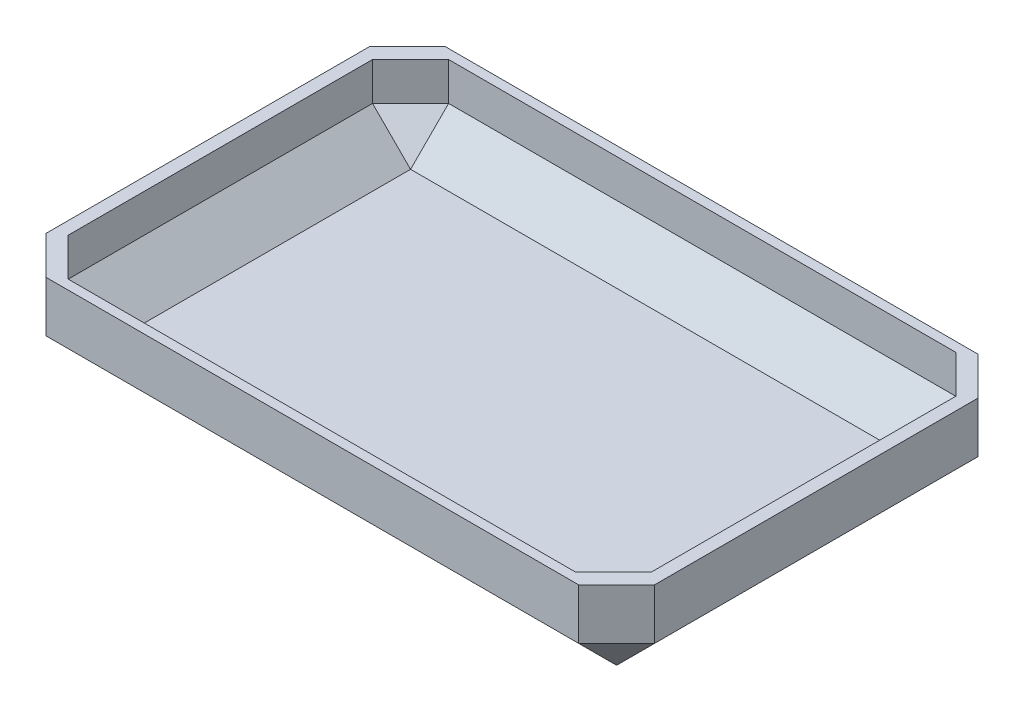
ISO-10303-21;
HEADER;
FILE_DESCRIPTION(('STEP AP214'),'2;1');
FILE_NAME('part.step','',(''),(''),'','','');
FILE_SCHEMA(('AUTOMOTIVE_DESIGN { 1 0 10303 214 1 1 1 1 }'));
ENDSEC;
DATA;
#1=APPLICATION_CONTEXT('core data for automotive mechanical design processes');
#2=APPLICATION_PROTOCOL_DEFINITION('international standard','automotive_design',2000,#1);
#3=PRODUCT_CONTEXT('',#1,'mechanical');
#4=PRODUCT('Part','Part','',(#3));
#5=PRODUCT_RELATED_PRODUCT_CATEGORY('part','',(#4));
#6=PRODUCT_DEFINITION_FORMATION('','',#4);
#7=PRODUCT_DEFINITION_CONTEXT('part definition',#1,'design');
#8=PRODUCT_DEFINITION('design','',#6,#7);
#9=PRODUCT_DEFINITION_SHAPE('','',#8);
#10=(LENGTH_UNIT() NAMED_UNIT(*) SI_UNIT(.MILLI.,.METRE.));
#11=(NAMED_UNIT(*) PLANE_ANGLE_UNIT() SI_UNIT($,.RADIAN.));
#12=(NAMED_UNIT(*) SI_UNIT($,.STERADIAN.) SOLID_ANGLE_UNIT());
#13=UNCERTAINTY_MEASURE_WITH_UNIT(LENGTH_MEASURE(1.E-05),#10,'distance_accuracy_value','');
#14=(GEOMETRIC_REPRESENTATION_CONTEXT(3) GLOBAL_UNCERTAINTY_ASSIGNED_CONTEXT((#13)) GLOBAL_UNIT_ASSIGNED_CONTEXT((#10,
#11,#12)) REPRESENTATION_CONTEXT('',''));
#15=CARTESIAN_POINT('',(0.,0.,0.));
#16=DIRECTION('',(0.,0.,1.));
#17=DIRECTION('',(1.,0.,0.));
#18=AXIS2_PLACEMENT_3D('',#15,#16,#17);
#19=CARTESIAN_POINT('',(-240.,70.,-157.5));
#20=DIRECTION('',(1.,0.,0.));
#21=DIRECTION('',(0.,0.,-1.));
#22=AXIS2_PLACEMENT_3D('',#19,#20,#21);
#23=PLANE('',#22);
#24=DIRECTION('',(0.,0.,1.));
#25=VECTOR('',#24,1.);
#26=CARTESIAN_POINT('',(-240.,30.,157.5));
#27=LINE('',#26,#25);
#28=CARTESIAN_POINT('',(-240.,30.,-127.5));
#29=VERTEX_POINT('',#28);
#30=CARTESIAN_POINT('',(-240.,30.,127.5));
#31=VERTEX_POINT('',#30);
#32=EDGE_CURVE('E268',#29,#31,#27,.T.);
#33=ORIENTED_EDGE('',*,*,#32,.T.);
#34=DIRECTION('',(0.,1.,0.));
#35=VECTOR('',#34,1.);
#36=CARTESIAN_POINT('',(-240.,70.,127.5));
#37=LINE('',#36,#35);
#38=CARTESIAN_POINT('',(-240.,70.,127.5));
#39=VERTEX_POINT('',#38);
#40=EDGE_CURVE('E272',#31,#39,#37,.T.);
#41=ORIENTED_EDGE('',*,*,#40,.T.);
#42=DIRECTION('',(0.,0.,1.));
#43=VECTOR('',#42,1.);
#44=CARTESIAN_POINT('',(-240.,70.,-157.5));
#45=LINE('',#44,#43);
#46=CARTESIAN_POINT('',(-240.,70.,-127.5));
#47=VERTEX_POINT('',#46);
#48=EDGE_CURVE('E222',#47,#39,#45,.T.);
#49=ORIENTED_EDGE('',*,*,#48,.F.);
#50=DIRECTION('',(0.,-1.,0.));
#51=VECTOR('',#50,1.);
#52=CARTESIAN_POINT('',(-240.,70.,-127.5));
#53=LINE('',#52,#51);
#54=EDGE_CURVE('E270',#47,#29,#53,.T.);
#55=ORIENTED_EDGE('',*,*,#54,.T.);
#56=EDGE_LOOP('',(#33,#41,#49,#55));
#57=FACE_BOUND('',#56,.T.);
#58=ADVANCED_FACE('F41',(#57),#23,.F.);
#59=CARTESIAN_POINT('',(240.,70.,157.5));
#60=DIRECTION('',(0.,0.,-1.));
#61=DIRECTION('',(-1.,0.,0.));
#62=AXIS2_PLACEMENT_3D('',#59,#60,#61);
#63=PLANE('',#62);
#64=DIRECTION('',(1.,0.,0.));
#65=VECTOR('',#64,1.);
#66=CARTESIAN_POINT('',(240.,70.,157.5));
#67=LINE('',#66,#65);
#68=CARTESIAN_POINT('',(-210.,70.,157.5));
#69=VERTEX_POINT('',#68);
#70=CARTESIAN_POINT('',(210.,70.,157.5));
#71=VERTEX_POINT('',#70);
#72=EDGE_CURVE('E225',#69,#71,#67,.T.);
#73=ORIENTED_EDGE('',*,*,#72,.F.);
#74=DIRECTION('',(0.,-1.,0.));
#75=VECTOR('',#74,1.);
#76=CARTESIAN_POINT('',(-210.,70.,157.5));
#77=LINE('',#76,#75);
#78=CARTESIAN_POINT('',(-210.,30.,157.5));
#79=VERTEX_POINT('',#78);
#80=EDGE_CURVE('E265',#69,#79,#77,.T.);
#81=ORIENTED_EDGE('',*,*,#80,.T.);
#82=DIRECTION('',(1.,0.,0.));
#83=VECTOR('',#82,1.);
#84=CARTESIAN_POINT('',(240.,30.,157.5));
#85=LINE('',#84,#83);
#86=CARTESIAN_POINT('',(210.,30.,157.5));
#87=VERTEX_POINT('',#86);
#88=EDGE_CURVE('E261',#79,#87,#85,.T.);
#89=ORIENTED_EDGE('',*,*,#88,.T.);
#90=DIRECTION('',(0.,1.,0.));
#91=VECTOR('',#90,1.);
#92=CARTESIAN_POINT('',(210.,70.,157.5));
#93=LINE('',#92,#91);
#94=EDGE_CURVE('E263',#87,#71,#93,.T.);
#95=ORIENTED_EDGE('',*,*,#94,.T.);
#96=EDGE_LOOP('',(#73,#81,#89,#95));
#97=FACE_BOUND('',#96,.T.);
#98=ADVANCED_FACE('F435',(#97),#63,.F.);
#99=CARTESIAN_POINT('',(240.,70.,-157.5));
#100=DIRECTION('',(-1.,0.,0.));
#101=DIRECTION('',(0.,0.,1.));
#102=AXIS2_PLACEMENT_3D('',#99,#100,#101);
#103=PLANE('',#102);
#104=DIRECTION('',(0.,0.,-1.));
#105=VECTOR('',#104,1.);
#106=CARTESIAN_POINT('',(240.,70.,-157.5));
#107=LINE('',#106,#105);
#108=CARTESIAN_POINT('',(240.,70.,127.5));
#109=VERTEX_POINT('',#108);
#110=CARTESIAN_POINT('',(240.,70.,-127.5));
#111=VERTEX_POINT('',#110);
#112=EDGE_CURVE('E228',#109,#111,#107,.T.);
#113=ORIENTED_EDGE('',*,*,#112,.F.);
#114=DIRECTION('',(0.,-1.,0.));
#115=VECTOR('',#114,1.);
#116=CARTESIAN_POINT('',(240.,70.,127.5));
#117=LINE('',#116,#115);
#118=CARTESIAN_POINT('',(240.,30.0000000000001,127.5));
#119=VERTEX_POINT('',#118);
#120=EDGE_CURVE('E278',#109,#119,#117,.T.);
#121=ORIENTED_EDGE('',*,*,#120,.T.);
#122=DIRECTION('',(0.,0.,-1.));
#123=VECTOR('',#122,1.);
#124=CARTESIAN_POINT('',(240.,30.0000000000001,-157.5));
#125=LINE('',#124,#123);
#126=CARTESIAN_POINT('',(240.,30.0000000000001,-127.5));
#127=VERTEX_POINT('',#126);
#128=EDGE_CURVE('E276',#119,#127,#125,.T.);
#129=ORIENTED_EDGE('',*,*,#128,.T.);
#130=DIRECTION('',(0.,1.,0.));
#131=VECTOR('',#130,1.);
#132=CARTESIAN_POINT('',(240.,70.,-127.5));
#133=LINE('',#132,#131);
#134=EDGE_CURVE('E274',#127,#111,#133,.T.);
#135=ORIENTED_EDGE('',*,*,#134,.T.);
#136=EDGE_LOOP('',(#113,#121,#129,#135));
#137=FACE_BOUND('',#136,.T.);
#138=ADVANCED_FACE('F378',(#137),#103,.F.);
#139=CARTESIAN_POINT('',(240.,70.,-157.5));
#140=DIRECTION('',(0.,0.,1.));
#141=DIRECTION('',(1.,0.,0.));
#142=AXIS2_PLACEMENT_3D('',#139,#140,#141);
#143=PLANE('',#142);
#144=DIRECTION('',(-1.,0.,0.));
#145=VECTOR('',#144,1.);
#146=CARTESIAN_POINT('',(-240.,30.,-157.5));
#147=LINE('',#146,#145);
#148=CARTESIAN_POINT('',(210.,30.,-157.5));
#149=VERTEX_POINT('',#148);
#150=CARTESIAN_POINT('',(-210.,30.,-157.5));
#151=VERTEX_POINT('',#150);
#152=EDGE_CURVE('E282',#149,#151,#147,.T.);
#153=ORIENTED_EDGE('',*,*,#152,.T.);
#154=DIRECTION('',(0.,1.,0.));
#155=VECTOR('',#154,1.);
#156=CARTESIAN_POINT('',(-210.,70.,-157.5));
#157=LINE('',#156,#155);
#158=CARTESIAN_POINT('',(-210.,70.,-157.5));
#159=VERTEX_POINT('',#158);
#160=EDGE_CURVE('E284',#151,#159,#157,.T.);
#161=ORIENTED_EDGE('',*,*,#160,.T.);
#162=DIRECTION('',(-1.,0.,0.));
#163=VECTOR('',#162,1.);
#164=CARTESIAN_POINT('',(240.,70.,-157.5));
#165=LINE('',#164,#163);
#166=CARTESIAN_POINT('',(210.,70.,-157.5));
#167=VERTEX_POINT('',#166);
#168=EDGE_CURVE('E231',#167,#159,#165,.T.);
#169=ORIENTED_EDGE('',*,*,#168,.F.);
#170=DIRECTION('',(0.,-1.,0.));
#171=VECTOR('',#170,1.);
#172=CARTESIAN_POINT('',(210.,70.,-157.5));
#173=LINE('',#172,#171);
#174=EDGE_CURVE('E280',#167,#149,#173,.T.);
#175=ORIENTED_EDGE('',*,*,#174,.T.);
#176=EDGE_LOOP('',(#153,#161,#169,#175));
#177=FACE_BOUND('',#176,.T.);
#178=ADVANCED_FACE('F431',(#177),#143,.F.);
#179=CARTESIAN_POINT('',(0.,70.,0.));
#180=DIRECTION('',(0.,-1.,0.));
#181=DIRECTION('',(0.,0.,-1.));
#182=AXIS2_PLACEMENT_3D('',#179,#180,#181);
#183=PLANE('',#182);
#184=DIRECTION('',(-1.,0.,0.));
#185=VECTOR('',#184,1.);
#186=CARTESIAN_POINT('',(-230.,70.,-150.));
#187=LINE('',#186,#185);
#188=CARTESIAN_POINT('',(200.,70.,-150.));
#189=VERTEX_POINT('',#188);
#190=CARTESIAN_POINT('',(-200.,70.,-150.));
#191=VERTEX_POINT('',#190);
#192=EDGE_CURVE('E198',#189,#191,#187,.T.);
#193=ORIENTED_EDGE('',*,*,#192,.F.);
#194=DIRECTION('',(-0.707106781186551,0.,-0.707106781186544));
#195=VECTOR('',#194,1.);
#196=CARTESIAN_POINT('',(174.999999999999,70.,-175.000000000001));
#197=LINE('',#196,#195);
#198=CARTESIAN_POINT('',(230.,70.,-120.));
#199=VERTEX_POINT('',#198);
#200=EDGE_CURVE('E182',#189,#199,#197,.F.);
#201=ORIENTED_EDGE('',*,*,#200,.T.);
#202=DIRECTION('',(0.,0.,-1.));
#203=VECTOR('',#202,1.);
#204=CARTESIAN_POINT('',(230.,70.,-150.));
#205=LINE('',#204,#203);
#206=CARTESIAN_POINT('',(230.,70.,120.));
#207=VERTEX_POINT('',#206);
#208=EDGE_CURVE('E212',#207,#199,#205,.T.);
#209=ORIENTED_EDGE('',*,*,#208,.F.);
#210=DIRECTION('',(0.707106781186543,0.,-0.707106781186552));
#211=VECTOR('',#210,1.);
#212=CARTESIAN_POINT('',(175.000000000001,70.,174.999999999999));
#213=LINE('',#212,#211);
#214=CARTESIAN_POINT('',(200.,70.,150.));
#215=VERTEX_POINT('',#214);
#216=EDGE_CURVE('E293',#207,#215,#213,.F.);
#217=ORIENTED_EDGE('',*,*,#216,.T.);
#218=DIRECTION('',(1.,0.,0.));
#219=VECTOR('',#218,1.);
#220=CARTESIAN_POINT('',(-230.,70.,150.));
#221=LINE('',#220,#219);
#222=CARTESIAN_POINT('',(-200.,70.,150.));
#223=VERTEX_POINT('',#222);
#224=EDGE_CURVE('E215',#223,#215,#221,.T.);
#225=ORIENTED_EDGE('',*,*,#224,.F.);
#226=DIRECTION('',(0.707106781186544,0.,0.707106781186551));
#227=VECTOR('',#226,1.);
#228=CARTESIAN_POINT('',(-175.000000000001,70.,174.999999999999));
#229=LINE('',#228,#227);
#230=CARTESIAN_POINT('',(-230.,70.,120.));
#231=VERTEX_POINT('',#230);
#232=EDGE_CURVE('E192',#223,#231,#229,.F.);
#233=ORIENTED_EDGE('',*,*,#232,.T.);
#234=DIRECTION('',(0.,0.,1.));
#235=VECTOR('',#234,1.);
#236=CARTESIAN_POINT('',(-230.,70.,-150.));
#237=LINE('',#236,#235);
#238=CARTESIAN_POINT('',(-230.,70.,-120.));
#239=VERTEX_POINT('',#238);
#240=EDGE_CURVE('E211',#239,#231,#237,.T.);
#241=ORIENTED_EDGE('',*,*,#240,.F.);
#242=DIRECTION('',(-0.707106781186544,0.,0.707106781186551));
#243=VECTOR('',#242,1.);
#244=CARTESIAN_POINT('',(-175.000000000001,70.,-174.999999999999));
#245=LINE('',#244,#243);
#246=EDGE_CURVE('E210',#239,#191,#245,.F.);
#247=ORIENTED_EDGE('',*,*,#246,.T.);
#248=EDGE_LOOP('',(#193,#201,#209,#217,#225,#233,#241,#247));
#249=FACE_BOUND('',#248,.T.);
#250=ORIENTED_EDGE('',*,*,#48,.T.);
#251=DIRECTION('',(-0.707106781186546,0.,-0.707106781186549));
#252=VECTOR('',#251,1.);
#253=CARTESIAN_POINT('',(-210.,70.,157.5));
#254=LINE('',#253,#252);
#255=EDGE_CURVE('E11',#39,#69,#254,.F.);
#256=ORIENTED_EDGE('',*,*,#255,.T.);
#257=ORIENTED_EDGE('',*,*,#72,.T.);
#258=DIRECTION('',(-0.707106781186547,0.,0.707106781186549));
#259=VECTOR('',#258,1.);
#260=CARTESIAN_POINT('',(240.,70.,127.5));
#261=LINE('',#260,#259);
#262=EDGE_CURVE('E51',#71,#109,#261,.F.);
#263=ORIENTED_EDGE('',*,*,#262,.T.);
#264=ORIENTED_EDGE('',*,*,#112,.T.);
#265=DIRECTION('',(0.707106781186546,0.,0.707106781186549));
#266=VECTOR('',#265,1.);
#267=CARTESIAN_POINT('',(210.,70.,-157.5));
#268=LINE('',#267,#266);
#269=EDGE_CURVE('E296',#111,#167,#268,.F.);
#270=ORIENTED_EDGE('',*,*,#269,.T.);
#271=ORIENTED_EDGE('',*,*,#168,.T.);
#272=DIRECTION('',(0.707106781186546,0.,-0.707106781186549));
#273=VECTOR('',#272,1.);
#274=CARTESIAN_POINT('',(-240.,70.,-127.5));
#275=LINE('',#274,#273);
#276=EDGE_CURVE('E298',#159,#47,#275,.F.);
#277=ORIENTED_EDGE('',*,*,#276,.T.);
#278=EDGE_LOOP('',(#250,#256,#257,#263,#264,#270,#271,#277));
#279=FACE_BOUND('',#278,.T.);
#280=ADVANCED_FACE('F206',(#249,#279),#183,.F.);
#281=CARTESIAN_POINT('',(0.,0.,0.));
#282=DIRECTION('',(0.,-1.,0.));
#283=DIRECTION('',(0.,0.,-1.));
#284=AXIS2_PLACEMENT_3D('',#281,#282,#283);
#285=PLANE('',#284);
#286=DIRECTION('',(-1.,0.,0.));
#287=VECTOR('',#286,1.);
#288=CARTESIAN_POINT('',(-240.,0.,127.5));
#289=LINE('',#288,#287);
#290=CARTESIAN_POINT('',(210.,0.,127.5));
#291=VERTEX_POINT('',#290);
#292=CARTESIAN_POINT('',(-210.,0.,127.5));
#293=VERTEX_POINT('',#292);
#294=EDGE_CURVE('E59',#291,#293,#289,.T.);
#295=ORIENTED_EDGE('',*,*,#294,.T.);
#296=DIRECTION('',(0.,0.,-1.));
#297=VECTOR('',#296,1.);
#298=CARTESIAN_POINT('',(-210.,0.,-157.5));
#299=LINE('',#298,#297);
#300=CARTESIAN_POINT('',(-210.,0.,-127.5));
#301=VERTEX_POINT('',#300);
#302=EDGE_CURVE('E193',#293,#301,#299,.T.);
#303=ORIENTED_EDGE('',*,*,#302,.T.);
#304=DIRECTION('',(1.,0.,0.));
#305=VECTOR('',#304,1.);
#306=CARTESIAN_POINT('',(240.,0.,-127.5));
#307=LINE('',#306,#305);
#308=CARTESIAN_POINT('',(210.,0.,-127.5));
#309=VERTEX_POINT('',#308);
#310=EDGE_CURVE('E288',#301,#309,#307,.T.);
#311=ORIENTED_EDGE('',*,*,#310,.T.);
#312=DIRECTION('',(0.,0.,1.));
#313=VECTOR('',#312,1.);
#314=CARTESIAN_POINT('',(210.,0.,157.5));
#315=LINE('',#314,#313);
#316=EDGE_CURVE('E286',#309,#291,#315,.T.);
#317=ORIENTED_EDGE('',*,*,#316,.T.);
#318=EDGE_LOOP('',(#295,#303,#311,#317));
#319=FACE_BOUND('',#318,.T.);
#320=ADVANCED_FACE('F420',(#319),#285,.T.);
#321=CARTESIAN_POINT('',(230.,10.,-150.));
#322=DIRECTION('',(1.,0.,0.));
#323=DIRECTION('',(0.,0.,-1.));
#324=AXIS2_PLACEMENT_3D('',#321,#322,#323);
#325=PLANE('',#324);
#326=ORIENTED_EDGE('',*,*,#208,.T.);
#327=DIRECTION('',(0.,-1.,0.));
#328=VECTOR('',#327,1.);
#329=CARTESIAN_POINT('',(230.,10.,-120.));
#330=LINE('',#329,#328);
#331=CARTESIAN_POINT('',(230.,40.0000000000001,-120.));
#332=VERTEX_POINT('',#331);
#333=EDGE_CURVE('E187',#199,#332,#330,.T.);
#334=ORIENTED_EDGE('',*,*,#333,.T.);
#335=DIRECTION('',(0.,0.,1.));
#336=VECTOR('',#335,1.);
#337=CARTESIAN_POINT('',(230.,40.0000000000001,-150.));
#338=LINE('',#337,#336);
#339=CARTESIAN_POINT('',(230.,40.0000000000001,120.));
#340=VERTEX_POINT('',#339);
#341=EDGE_CURVE('E203',#332,#340,#338,.T.);
#342=ORIENTED_EDGE('',*,*,#341,.T.);
#343=DIRECTION('',(0.,1.,0.));
#344=VECTOR('',#343,1.);
#345=CARTESIAN_POINT('',(230.,70.,120.));
#346=LINE('',#345,#344);
#347=EDGE_CURVE('E237',#340,#207,#346,.T.);
#348=ORIENTED_EDGE('',*,*,#347,.T.);
#349=EDGE_LOOP('',(#326,#334,#342,#348));
#350=FACE_BOUND('',#349,.T.);
#351=ADVANCED_FACE('F422',(#350),#325,.F.);
#352=CARTESIAN_POINT('',(-230.,10.,150.));
#353=DIRECTION('',(0.,0.,1.));
#354=DIRECTION('',(1.,0.,0.));
#355=AXIS2_PLACEMENT_3D('',#352,#353,#354);
#356=PLANE('',#355);
#357=DIRECTION('',(-1.,0.,0.));
#358=VECTOR('',#357,1.);
#359=CARTESIAN_POINT('',(-230.,40.0000000000001,150.));
#360=LINE('',#359,#358);
#361=CARTESIAN_POINT('',(200.,40.0000000000001,150.));
#362=VERTEX_POINT('',#361);
#363=CARTESIAN_POINT('',(-200.,40.0000000000001,150.));
#364=VERTEX_POINT('',#363);
#365=EDGE_CURVE('E240',#362,#364,#360,.T.);
#366=ORIENTED_EDGE('',*,*,#365,.T.);
#367=DIRECTION('',(0.,1.,0.));
#368=VECTOR('',#367,1.);
#369=CARTESIAN_POINT('',(-200.,70.,150.));
#370=LINE('',#369,#368);
#371=EDGE_CURVE('E244',#364,#223,#370,.T.);
#372=ORIENTED_EDGE('',*,*,#371,.T.);
#373=ORIENTED_EDGE('',*,*,#224,.T.);
#374=DIRECTION('',(0.,-1.,0.));
#375=VECTOR('',#374,1.);
#376=CARTESIAN_POINT('',(200.,10.,150.));
#377=LINE('',#376,#375);
#378=EDGE_CURVE('E242',#215,#362,#377,.T.);
#379=ORIENTED_EDGE('',*,*,#378,.T.);
#380=EDGE_LOOP('',(#366,#372,#373,#379));
#381=FACE_BOUND('',#380,.T.);
#382=ADVANCED_FACE('F428',(#381),#356,.F.);
#383=CARTESIAN_POINT('',(-230.,10.,-150.));
#384=DIRECTION('',(-1.,0.,0.));
#385=DIRECTION('',(0.,0.,1.));
#386=AXIS2_PLACEMENT_3D('',#383,#384,#385);
#387=PLANE('',#386);
#388=ORIENTED_EDGE('',*,*,#240,.T.);
#389=DIRECTION('',(0.,-1.,0.));
#390=VECTOR('',#389,1.);
#391=CARTESIAN_POINT('',(-230.,10.,120.));
#392=LINE('',#391,#390);
#393=CARTESIAN_POINT('',(-230.,40.0000000000001,120.));
#394=VERTEX_POINT('',#393);
#395=EDGE_CURVE('E250',#231,#394,#392,.T.);
#396=ORIENTED_EDGE('',*,*,#395,.T.);
#397=DIRECTION('',(0.,0.,-1.));
#398=VECTOR('',#397,1.);
#399=CARTESIAN_POINT('',(-230.,40.0000000000001,-150.));
#400=LINE('',#399,#398);
#401=CARTESIAN_POINT('',(-230.,40.0000000000001,-120.));
#402=VERTEX_POINT('',#401);
#403=EDGE_CURVE('E246',#394,#402,#400,.T.);
#404=ORIENTED_EDGE('',*,*,#403,.T.);
#405=DIRECTION('',(0.,1.,0.));
#406=VECTOR('',#405,1.);
#407=CARTESIAN_POINT('',(-230.,70.,-120.));
#408=LINE('',#407,#406);
#409=EDGE_CURVE('E248',#402,#239,#408,.T.);
#410=ORIENTED_EDGE('',*,*,#409,.T.);
#411=EDGE_LOOP('',(#388,#396,#404,#410));
#412=FACE_BOUND('',#411,.T.);
#413=ADVANCED_FACE('F646',(#412),#387,.F.);
#414=CARTESIAN_POINT('',(-230.,10.,-150.));
#415=DIRECTION('',(0.,0.,-1.));
#416=DIRECTION('',(-1.,0.,0.));
#417=AXIS2_PLACEMENT_3D('',#414,#415,#416);
#418=PLANE('',#417);
#419=DIRECTION('',(1.,0.,0.));
#420=VECTOR('',#419,1.);
#421=CARTESIAN_POINT('',(-230.,40.0000000000001,-150.));
#422=LINE('',#421,#420);
#423=CARTESIAN_POINT('',(-200.,40.0000000000001,-150.));
#424=VERTEX_POINT('',#423);
#425=CARTESIAN_POINT('',(200.,40.0000000000001,-150.));
#426=VERTEX_POINT('',#425);
#427=EDGE_CURVE('E201',#424,#426,#422,.T.);
#428=ORIENTED_EDGE('',*,*,#427,.T.);
#429=DIRECTION('',(0.,1.,0.));
#430=VECTOR('',#429,1.);
#431=CARTESIAN_POINT('',(200.,70.,-150.));
#432=LINE('',#431,#430);
#433=EDGE_CURVE('E186',#426,#189,#432,.T.);
#434=ORIENTED_EDGE('',*,*,#433,.T.);
#435=ORIENTED_EDGE('',*,*,#192,.T.);
#436=DIRECTION('',(0.,-1.,0.));
#437=VECTOR('',#436,1.);
#438=CARTESIAN_POINT('',(-200.,10.,-150.));
#439=LINE('',#438,#437);
#440=EDGE_CURVE('E204',#191,#424,#439,.T.);
#441=ORIENTED_EDGE('',*,*,#440,.T.);
#442=EDGE_LOOP('',(#428,#434,#435,#441));
#443=FACE_BOUND('',#442,.T.);
#444=ADVANCED_FACE('F197',(#443),#418,.F.);
#445=CARTESIAN_POINT('',(0.,10.,0.));
#446=DIRECTION('',(0.,1.,0.));
#447=DIRECTION('',(0.,0.,1.));
#448=AXIS2_PLACEMENT_3D('',#445,#446,#447);
#449=PLANE('',#448);
#450=DIRECTION('',(-1.,0.,0.));
#451=VECTOR('',#450,1.);
#452=CARTESIAN_POINT('',(0.,10.,-120.));
#453=LINE('',#452,#451);
#454=CARTESIAN_POINT('',(200.,10.,-120.));
#455=VERTEX_POINT('',#454);
#456=CARTESIAN_POINT('',(-199.999999999999,10.,-120.));
#457=VERTEX_POINT('',#456);
#458=EDGE_CURVE('E256',#455,#457,#453,.T.);
#459=ORIENTED_EDGE('',*,*,#458,.T.);
#460=DIRECTION('',(0.,0.,1.));
#461=VECTOR('',#460,1.);
#462=CARTESIAN_POINT('',(-199.999999999999,10.,0.));
#463=LINE('',#462,#461);
#464=CARTESIAN_POINT('',(-199.999999999999,10.,120.));
#465=VERTEX_POINT('',#464);
#466=EDGE_CURVE('E258',#457,#465,#463,.T.);
#467=ORIENTED_EDGE('',*,*,#466,.T.);
#468=DIRECTION('',(1.,0.,0.));
#469=VECTOR('',#468,1.);
#470=CARTESIAN_POINT('',(0.,10.,120.));
#471=LINE('',#470,#469);
#472=CARTESIAN_POINT('',(200.,10.,120.));
#473=VERTEX_POINT('',#472);
#474=EDGE_CURVE('E252',#465,#473,#471,.T.);
#475=ORIENTED_EDGE('',*,*,#474,.T.);
#476=DIRECTION('',(0.,0.,-1.));
#477=VECTOR('',#476,1.);
#478=CARTESIAN_POINT('',(200.,10.,0.));
#479=LINE('',#478,#477);
#480=EDGE_CURVE('E254',#473,#455,#479,.T.);
#481=ORIENTED_EDGE('',*,*,#480,.T.);
#482=EDGE_LOOP('',(#459,#467,#475,#481));
#483=FACE_BOUND('',#482,.T.);
#484=ADVANCED_FACE('F525',(#483),#449,.T.);
#485=CARTESIAN_POINT('',(-200.,10.,150.));
#486=DIRECTION('',(0.707106781186551,0.,-0.707106781186544));
#487=DIRECTION('',(0.,-1.,0.));
#488=AXIS2_PLACEMENT_3D('',#485,#486,#487);
#489=PLANE('',#488);
#490=DIRECTION('',(-0.707106781186544,0.,-0.707106781186551));
#491=VECTOR('',#490,1.);
#492=CARTESIAN_POINT('',(-230.,40.0000000000001,120.));
#493=LINE('',#492,#491);
#494=EDGE_CURVE('E217',#394,#364,#493,.F.);
#495=ORIENTED_EDGE('',*,*,#494,.F.);
#496=ORIENTED_EDGE('',*,*,#395,.F.);
#497=ORIENTED_EDGE('',*,*,#232,.F.);
#498=ORIENTED_EDGE('',*,*,#371,.F.);
#499=EDGE_LOOP('',(#495,#496,#497,#498));
#500=FACE_BOUND('',#499,.T.);
#501=ADVANCED_FACE('F519',(#500),#489,.T.);
#502=CARTESIAN_POINT('',(-230.,40.0000000000001,120.));
#503=DIRECTION('',(0.577350269189625,0.577350269189633,-0.577350269189619));
#504=DIRECTION('',(-0.707106781186552,0.707106781186543,0.));
#505=AXIS2_PLACEMENT_3D('',#502,#503,#504);
#506=PLANE('',#505);
#507=DIRECTION('',(-0.707106781186552,0.707106781186543,0.));
#508=VECTOR('',#507,1.);
#509=CARTESIAN_POINT('',(-230.,40.0000000000001,120.));
#510=LINE('',#509,#508);
#511=EDGE_CURVE('E327',#394,#465,#510,.F.);
#512=ORIENTED_EDGE('',*,*,#511,.F.);
#513=ORIENTED_EDGE('',*,*,#494,.T.);
#514=DIRECTION('',(0.,-0.707106781186543,-0.707106781186551));
#515=VECTOR('',#514,1.);
#516=CARTESIAN_POINT('',(-200.,25.0000000000001,135.));
#517=LINE('',#516,#515);
#518=EDGE_CURVE('E330',#465,#364,#517,.F.);
#519=ORIENTED_EDGE('',*,*,#518,.F.);
#520=EDGE_LOOP('',(#512,#513,#519));
#521=FACE_BOUND('',#520,.T.);
#522=ADVANCED_FACE('F512',(#521),#506,.T.);
#523=CARTESIAN_POINT('',(230.,10.,120.));
#524=DIRECTION('',(-0.707106781186552,0.,-0.707106781186543));
#525=DIRECTION('',(0.,-1.,0.));
#526=AXIS2_PLACEMENT_3D('',#523,#524,#525);
#527=PLANE('',#526);
#528=ORIENTED_EDGE('',*,*,#216,.F.);
#529=ORIENTED_EDGE('',*,*,#347,.F.);
#530=DIRECTION('',(-0.707106781186543,0.,0.707106781186552));
#531=VECTOR('',#530,1.);
#532=CARTESIAN_POINT('',(200.,40.0000000000001,150.));
#533=LINE('',#532,#531);
#534=EDGE_CURVE('E324',#362,#340,#533,.F.);
#535=ORIENTED_EDGE('',*,*,#534,.F.);
#536=ORIENTED_EDGE('',*,*,#378,.F.);
#537=EDGE_LOOP('',(#528,#529,#535,#536));
#538=FACE_BOUND('',#537,.T.);
#539=ADVANCED_FACE('F505',(#538),#527,.T.);
#540=CARTESIAN_POINT('',(0.,10.,120.));
#541=DIRECTION('',(0.,-0.707106781186551,0.707106781186544));
#542=DIRECTION('',(1.,0.,0.));
#543=AXIS2_PLACEMENT_3D('',#540,#541,#542);
#544=PLANE('',#543);
#545=ORIENTED_EDGE('',*,*,#518,.T.);
#546=ORIENTED_EDGE('',*,*,#365,.F.);
#547=DIRECTION('',(0.,0.707106781186544,0.707106781186551));
#548=VECTOR('',#547,1.);
#549=CARTESIAN_POINT('',(200.,40.0000000000001,150.));
#550=LINE('',#549,#548);
#551=EDGE_CURVE('E321',#473,#362,#550,.T.);
#552=ORIENTED_EDGE('',*,*,#551,.F.);
#553=ORIENTED_EDGE('',*,*,#474,.F.);
#554=EDGE_LOOP('',(#545,#546,#552,#553));
#555=FACE_BOUND('',#554,.T.);
#556=ADVANCED_FACE('F498',(#555),#544,.F.);
#557=CARTESIAN_POINT('',(-199.999999999999,10.,0.));
#558=DIRECTION('',(-0.707106781186543,-0.707106781186552,0.));
#559=DIRECTION('',(0.,0.,1.));
#560=AXIS2_PLACEMENT_3D('',#557,#558,#559);
#561=PLANE('',#560);
#562=ORIENTED_EDGE('',*,*,#511,.T.);
#563=ORIENTED_EDGE('',*,*,#466,.F.);
#564=DIRECTION('',(0.707106781186552,-0.707106781186543,0.));
#565=VECTOR('',#564,1.);
#566=CARTESIAN_POINT('',(-215.,25.0000000000001,-120.));
#567=LINE('',#566,#565);
#568=EDGE_CURVE('E318',#402,#457,#567,.T.);
#569=ORIENTED_EDGE('',*,*,#568,.F.);
#570=ORIENTED_EDGE('',*,*,#403,.F.);
#571=EDGE_LOOP('',(#562,#563,#569,#570));
#572=FACE_BOUND('',#571,.T.);
#573=ADVANCED_FACE('F491',(#572),#561,.F.);
#574=CARTESIAN_POINT('',(-230.,10.,-120.));
#575=DIRECTION('',(0.707106781186551,0.,0.707106781186544));
#576=DIRECTION('',(0.,-1.,0.));
#577=AXIS2_PLACEMENT_3D('',#574,#575,#576);
#578=PLANE('',#577);
#579=ORIENTED_EDGE('',*,*,#246,.F.);
#580=ORIENTED_EDGE('',*,*,#409,.F.);
#581=DIRECTION('',(0.707106781186544,0.,-0.707106781186551));
#582=VECTOR('',#581,1.);
#583=CARTESIAN_POINT('',(-200.,40.0000000000001,-150.));
#584=LINE('',#583,#582);
#585=EDGE_CURVE('E315',#424,#402,#584,.F.);
#586=ORIENTED_EDGE('',*,*,#585,.F.);
#587=ORIENTED_EDGE('',*,*,#440,.F.);
#588=EDGE_LOOP('',(#579,#580,#586,#587));
#589=FACE_BOUND('',#588,.T.);
#590=ADVANCED_FACE('F484',(#589),#578,.T.);
#591=CARTESIAN_POINT('',(200.,40.0000000000001,150.));
#592=DIRECTION('',(-0.577350269189627,0.577350269189632,-0.577350269189619));
#593=DIRECTION('',(-0.707106781186551,-0.707106781186544,0.));
#594=AXIS2_PLACEMENT_3D('',#591,#592,#593);
#595=PLANE('',#594);
#596=ORIENTED_EDGE('',*,*,#551,.T.);
#597=ORIENTED_EDGE('',*,*,#534,.T.);
#598=DIRECTION('',(-0.707106781186551,-0.707106781186544,0.));
#599=VECTOR('',#598,1.);
#600=CARTESIAN_POINT('',(215.,25.0000000000001,120.));
#601=LINE('',#600,#599);
#602=EDGE_CURVE('E312',#473,#340,#601,.F.);
#603=ORIENTED_EDGE('',*,*,#602,.F.);
#604=EDGE_LOOP('',(#596,#597,#603));
#605=FACE_BOUND('',#604,.T.);
#606=ADVANCED_FACE('F477',(#605),#595,.T.);
#607=CARTESIAN_POINT('',(-200.,40.0000000000001,-150.));
#608=DIRECTION('',(0.577350269189625,0.577350269189633,0.577350269189619));
#609=DIRECTION('',(-0.707106781186552,0.707106781186543,0.));
#610=AXIS2_PLACEMENT_3D('',#607,#608,#609);
#611=PLANE('',#610);
#612=ORIENTED_EDGE('',*,*,#585,.T.);
#613=ORIENTED_EDGE('',*,*,#568,.T.);
#614=DIRECTION('',(0.,0.707106781186543,-0.707106781186551));
#615=VECTOR('',#614,1.);
#616=CARTESIAN_POINT('',(-200.,40.0000000000001,-150.));
#617=LINE('',#616,#615);
#618=EDGE_CURVE('E309',#424,#457,#617,.F.);
#619=ORIENTED_EDGE('',*,*,#618,.F.);
#620=EDGE_LOOP('',(#612,#613,#619));
#621=FACE_BOUND('',#620,.T.);
#622=ADVANCED_FACE('F470',(#621),#611,.T.);
#623=CARTESIAN_POINT('',(200.,10.,0.));
#624=DIRECTION('',(0.707106781186544,-0.707106781186551,0.));
#625=DIRECTION('',(0.,0.,-1.));
#626=AXIS2_PLACEMENT_3D('',#623,#624,#625);
#627=PLANE('',#626);
#628=ORIENTED_EDGE('',*,*,#602,.T.);
#629=ORIENTED_EDGE('',*,*,#341,.F.);
#630=DIRECTION('',(0.707106781186551,0.707106781186544,0.));
#631=VECTOR('',#630,1.);
#632=CARTESIAN_POINT('',(230.,40.0000000000001,-120.));
#633=LINE('',#632,#631);
#634=EDGE_CURVE('E306',#455,#332,#633,.T.);
#635=ORIENTED_EDGE('',*,*,#634,.F.);
#636=ORIENTED_EDGE('',*,*,#480,.F.);
#637=EDGE_LOOP('',(#628,#629,#635,#636));
#638=FACE_BOUND('',#637,.T.);
#639=ADVANCED_FACE('F463',(#638),#627,.F.);
#640=CARTESIAN_POINT('',(0.,10.,-120.));
#641=DIRECTION('',(0.,-0.707106781186551,-0.707106781186544));
#642=DIRECTION('',(-1.,0.,0.));
#643=AXIS2_PLACEMENT_3D('',#640,#641,#642);
#644=PLANE('',#643);
#645=ORIENTED_EDGE('',*,*,#618,.T.);
#646=ORIENTED_EDGE('',*,*,#458,.F.);
#647=DIRECTION('',(0.,-0.707106781186544,0.707106781186551));
#648=VECTOR('',#647,1.);
#649=CARTESIAN_POINT('',(200.,25.,-135.));
#650=LINE('',#649,#648);
#651=EDGE_CURVE('E303',#426,#455,#650,.T.);
#652=ORIENTED_EDGE('',*,*,#651,.F.);
#653=ORIENTED_EDGE('',*,*,#427,.F.);
#654=EDGE_LOOP('',(#645,#646,#652,#653));
#655=FACE_BOUND('',#654,.T.);
#656=ADVANCED_FACE('F456',(#655),#644,.F.);
#657=CARTESIAN_POINT('',(230.,40.0000000000001,-120.));
#658=DIRECTION('',(-0.57735026918962,0.577350269189632,0.577350269189626));
#659=DIRECTION('',(0.,-0.707106781186544,0.707106781186551));
#660=AXIS2_PLACEMENT_3D('',#657,#658,#659);
#661=PLANE('',#660);
#662=ORIENTED_EDGE('',*,*,#651,.T.);
#663=ORIENTED_EDGE('',*,*,#634,.T.);
#664=DIRECTION('',(0.707106781186551,0.,0.707106781186544));
#665=VECTOR('',#664,1.);
#666=CARTESIAN_POINT('',(230.,40.0000000000001,-120.));
#667=LINE('',#666,#665);
#668=EDGE_CURVE('E301',#426,#332,#667,.T.);
#669=ORIENTED_EDGE('',*,*,#668,.F.);
#670=EDGE_LOOP('',(#662,#663,#669));
#671=FACE_BOUND('',#670,.T.);
#672=ADVANCED_FACE('F450',(#671),#661,.T.);
#673=CARTESIAN_POINT('',(200.,10.,-150.));
#674=DIRECTION('',(-0.707106781186544,0.,0.707106781186551));
#675=DIRECTION('',(0.,-1.,0.));
#676=AXIS2_PLACEMENT_3D('',#673,#674,#675);
#677=PLANE('',#676);
#678=ORIENTED_EDGE('',*,*,#668,.T.);
#679=ORIENTED_EDGE('',*,*,#333,.F.);
#680=ORIENTED_EDGE('',*,*,#200,.F.);
#681=ORIENTED_EDGE('',*,*,#433,.F.);
#682=EDGE_LOOP('',(#678,#679,#680,#681));
#683=FACE_BOUND('',#682,.T.);
#684=ADVANCED_FACE('F185',(#683),#677,.T.);
#685=CARTESIAN_POINT('',(210.,70.,-157.5));
#686=DIRECTION('',(-0.707106781186549,0.,0.707106781186546));
#687=DIRECTION('',(0.,-1.,0.));
#688=AXIS2_PLACEMENT_3D('',#685,#686,#687);
#689=PLANE('',#688);
#690=DIRECTION('',(-0.707106781186546,0.,-0.707106781186549));
#691=VECTOR('',#690,1.);
#692=CARTESIAN_POINT('',(225.,30.0000000000001,-142.5));
#693=LINE('',#692,#691);
#694=EDGE_CURVE('E46',#149,#127,#693,.F.);
#695=ORIENTED_EDGE('',*,*,#694,.F.);
#696=ORIENTED_EDGE('',*,*,#174,.F.);
#697=ORIENTED_EDGE('',*,*,#269,.F.);
#698=ORIENTED_EDGE('',*,*,#134,.F.);
#699=EDGE_LOOP('',(#695,#696,#697,#698));
#700=FACE_BOUND('',#699,.T.);
#701=ADVANCED_FACE('F44',(#700),#689,.F.);
#702=CARTESIAN_POINT('',(210.,0.,-127.5));
#703=DIRECTION('',(0.577350269189628,-0.577350269189625,-0.577350269189624));
#704=DIRECTION('',(0.707106781186546,0.707106781186549,0.));
#705=AXIS2_PLACEMENT_3D('',#702,#703,#704);
#706=PLANE('',#705);
#707=DIRECTION('',(0.,0.707106781186547,-0.707106781186548));
#708=VECTOR('',#707,1.);
#709=CARTESIAN_POINT('',(210.,0.,-127.5));
#710=LINE('',#709,#708);
#711=EDGE_CURVE('E358',#149,#309,#710,.F.);
#712=ORIENTED_EDGE('',*,*,#711,.F.);
#713=ORIENTED_EDGE('',*,*,#694,.T.);
#714=DIRECTION('',(-0.707106781186546,-0.707106781186549,0.));
#715=VECTOR('',#714,1.);
#716=CARTESIAN_POINT('',(210.,0.,-127.5));
#717=LINE('',#716,#715);
#718=EDGE_CURVE('E360',#309,#127,#717,.F.);
#719=ORIENTED_EDGE('',*,*,#718,.F.);
#720=EDGE_LOOP('',(#712,#713,#719));
#721=FACE_BOUND('',#720,.T.);
#722=ADVANCED_FACE('F370',(#721),#706,.T.);
#723=CARTESIAN_POINT('',(240.,70.,127.5));
#724=DIRECTION('',(-0.707106781186548,0.,-0.707106781186546));
#725=DIRECTION('',(0.,-1.,0.));
#726=AXIS2_PLACEMENT_3D('',#723,#724,#725);
#727=PLANE('',#726);
#728=ORIENTED_EDGE('',*,*,#262,.F.);
#729=ORIENTED_EDGE('',*,*,#94,.F.);
#730=DIRECTION('',(0.707106781186547,0.,-0.707106781186549));
#731=VECTOR('',#730,1.);
#732=CARTESIAN_POINT('',(240.,30.0000000000001,127.5));
#733=LINE('',#732,#731);
#734=EDGE_CURVE('E355',#119,#87,#733,.F.);
#735=ORIENTED_EDGE('',*,*,#734,.F.);
#736=ORIENTED_EDGE('',*,*,#120,.F.);
#737=EDGE_LOOP('',(#728,#729,#735,#736));
#738=FACE_BOUND('',#737,.T.);
#739=ADVANCED_FACE('F385',(#738),#727,.F.);
#740=CARTESIAN_POINT('',(240.,30.0000000000001,-157.5));
#741=DIRECTION('',(0.707106781186549,-0.707106781186546,0.));
#742=DIRECTION('',(0.,0.,1.));
#743=AXIS2_PLACEMENT_3D('',#740,#741,#742);
#744=PLANE('',#743);
#745=ORIENTED_EDGE('',*,*,#718,.T.);
#746=ORIENTED_EDGE('',*,*,#128,.F.);
#747=DIRECTION('',(0.707106781186546,0.707106781186549,0.));
#748=VECTOR('',#747,1.);
#749=CARTESIAN_POINT('',(240.,30.0000000000001,127.5));
#750=LINE('',#749,#748);
#751=EDGE_CURVE('E352',#291,#119,#750,.T.);
#752=ORIENTED_EDGE('',*,*,#751,.F.);
#753=ORIENTED_EDGE('',*,*,#316,.F.);
#754=EDGE_LOOP('',(#745,#746,#752,#753));
#755=FACE_BOUND('',#754,.T.);
#756=ADVANCED_FACE('F388',(#755),#744,.T.);
#757=CARTESIAN_POINT('',(240.,30.,-157.5));
#758=DIRECTION('',(0.,-0.707106781186548,-0.707106781186547));
#759=DIRECTION('',(1.,0.,0.));
#760=AXIS2_PLACEMENT_3D('',#757,#758,#759);
#761=PLANE('',#760);
#762=ORIENTED_EDGE('',*,*,#711,.T.);
#763=ORIENTED_EDGE('',*,*,#310,.F.);
#764=DIRECTION('',(0.,-0.707106781186547,0.707106781186548));
#765=VECTOR('',#764,1.);
#766=CARTESIAN_POINT('',(-210.,15.,-142.5));
#767=LINE('',#766,#765);
#768=EDGE_CURVE('E350',#151,#301,#767,.T.);
#769=ORIENTED_EDGE('',*,*,#768,.F.);
#770=ORIENTED_EDGE('',*,*,#152,.F.);
#771=EDGE_LOOP('',(#762,#763,#769,#770));
#772=FACE_BOUND('',#771,.T.);
#773=ADVANCED_FACE('F419',(#772),#761,.T.);
#774=CARTESIAN_POINT('',(-240.,70.,-127.5));
#775=DIRECTION('',(0.707106781186549,0.,0.707106781186546));
#776=DIRECTION('',(0.,-1.,0.));
#777=AXIS2_PLACEMENT_3D('',#774,#775,#776);
#778=PLANE('',#777);
#779=ORIENTED_EDGE('',*,*,#276,.F.);
#780=ORIENTED_EDGE('',*,*,#160,.F.);
#781=DIRECTION('',(-0.707106781186546,0.,0.707106781186549));
#782=VECTOR('',#781,1.);
#783=CARTESIAN_POINT('',(-240.,30.,-127.5));
#784=LINE('',#783,#782);
#785=EDGE_CURVE('E347',#29,#151,#784,.F.);
#786=ORIENTED_EDGE('',*,*,#785,.F.);
#787=ORIENTED_EDGE('',*,*,#54,.F.);
#788=EDGE_LOOP('',(#779,#780,#786,#787));
#789=FACE_BOUND('',#788,.T.);
#790=ADVANCED_FACE('F412',(#789),#778,.F.);
#791=CARTESIAN_POINT('',(240.,30.0000000000001,127.5));
#792=DIRECTION('',(0.577350269189628,-0.577350269189626,0.577350269189624));
#793=DIRECTION('',(0.707106781186547,0.707106781186548,0.));
#794=AXIS2_PLACEMENT_3D('',#791,#792,#793);
#795=PLANE('',#794);
#796=ORIENTED_EDGE('',*,*,#751,.T.);
#797=ORIENTED_EDGE('',*,*,#734,.T.);
#798=DIRECTION('',(0.,-0.707106781186546,-0.707106781186549));
#799=VECTOR('',#798,1.);
#800=CARTESIAN_POINT('',(210.,15.,142.5));
#801=LINE('',#800,#799);
#802=EDGE_CURVE('E344',#291,#87,#801,.F.);
#803=ORIENTED_EDGE('',*,*,#802,.F.);
#804=EDGE_LOOP('',(#796,#797,#803));
#805=FACE_BOUND('',#804,.T.);
#806=ADVANCED_FACE('F391',(#805),#795,.T.);
#807=CARTESIAN_POINT('',(-240.,30.,-127.5));
#808=DIRECTION('',(-0.577350269189626,-0.577350269189627,-0.577350269189624));
#809=DIRECTION('',(0.707106781186548,-0.707106781186547,0.));
#810=AXIS2_PLACEMENT_3D('',#807,#808,#809);
#811=PLANE('',#810);
#812=ORIENTED_EDGE('',*,*,#785,.T.);
#813=ORIENTED_EDGE('',*,*,#768,.T.);
#814=DIRECTION('',(-0.707106781186549,0.707106781186546,0.));
#815=VECTOR('',#814,1.);
#816=CARTESIAN_POINT('',(-240.,30.,-127.5));
#817=LINE('',#816,#815);
#818=EDGE_CURVE('E66',#29,#301,#817,.F.);
#819=ORIENTED_EDGE('',*,*,#818,.F.);
#820=EDGE_LOOP('',(#812,#813,#819));
#821=FACE_BOUND('',#820,.T.);
#822=ADVANCED_FACE('F416',(#821),#811,.T.);
#823=CARTESIAN_POINT('',(240.,30.,157.5));
#824=DIRECTION('',(0.,-0.707106781186549,0.707106781186546));
#825=DIRECTION('',(-1.,0.,0.));
#826=AXIS2_PLACEMENT_3D('',#823,#824,#825);
#827=PLANE('',#826);
#828=ORIENTED_EDGE('',*,*,#802,.T.);
#829=ORIENTED_EDGE('',*,*,#88,.F.);
#830=DIRECTION('',(0.,0.707106781186546,0.707106781186549));
#831=VECTOR('',#830,1.);
#832=CARTESIAN_POINT('',(-210.,30.,157.5));
#833=LINE('',#832,#831);
#834=EDGE_CURVE('E340',#293,#79,#833,.T.);
#835=ORIENTED_EDGE('',*,*,#834,.F.);
#836=ORIENTED_EDGE('',*,*,#294,.F.);
#837=EDGE_LOOP('',(#828,#829,#835,#836));
#838=FACE_BOUND('',#837,.T.);
#839=ADVANCED_FACE('F395',(#838),#827,.T.);
#840=CARTESIAN_POINT('',(-240.,30.,-157.5));
#841=DIRECTION('',(-0.707106781186546,-0.707106781186549,0.));
#842=DIRECTION('',(0.,0.,-1.));
#843=AXIS2_PLACEMENT_3D('',#840,#841,#842);
#844=PLANE('',#843);
#845=ORIENTED_EDGE('',*,*,#818,.T.);
#846=ORIENTED_EDGE('',*,*,#302,.F.);
#847=DIRECTION('',(0.707106781186549,-0.707106781186546,0.));
#848=VECTOR('',#847,1.);
#849=CARTESIAN_POINT('',(-225.,15.,127.5));
#850=LINE('',#849,#848);
#851=EDGE_CURVE('E337',#31,#293,#850,.T.);
#852=ORIENTED_EDGE('',*,*,#851,.F.);
#853=ORIENTED_EDGE('',*,*,#32,.F.);
#854=EDGE_LOOP('',(#845,#846,#852,#853));
#855=FACE_BOUND('',#854,.T.);
#856=ADVANCED_FACE('F401',(#855),#844,.T.);
#857=CARTESIAN_POINT('',(-210.,30.,157.5));
#858=DIRECTION('',(-0.577350269189626,-0.577350269189628,0.577350269189624));
#859=DIRECTION('',(0.707106781186548,-0.707106781186547,0.));
#860=AXIS2_PLACEMENT_3D('',#857,#858,#859);
#861=PLANE('',#860);
#862=ORIENTED_EDGE('',*,*,#851,.T.);
#863=ORIENTED_EDGE('',*,*,#834,.T.);
#864=DIRECTION('',(0.707106781186546,0.,0.707106781186549));
#865=VECTOR('',#864,1.);
#866=CARTESIAN_POINT('',(-210.,30.,157.5));
#867=LINE('',#866,#865);
#868=EDGE_CURVE('E335',#31,#79,#867,.T.);
#869=ORIENTED_EDGE('',*,*,#868,.F.);
#870=EDGE_LOOP('',(#862,#863,#869));
#871=FACE_BOUND('',#870,.T.);
#872=ADVANCED_FACE('F399',(#871),#861,.T.);
#873=CARTESIAN_POINT('',(-210.,70.,157.5));
#874=DIRECTION('',(0.707106781186549,0.,-0.707106781186546));
#875=DIRECTION('',(0.,-1.,0.));
#876=AXIS2_PLACEMENT_3D('',#873,#874,#875);
#877=PLANE('',#876);
#878=ORIENTED_EDGE('',*,*,#255,.F.);
#879=ORIENTED_EDGE('',*,*,#40,.F.);
#880=ORIENTED_EDGE('',*,*,#868,.T.);
#881=ORIENTED_EDGE('',*,*,#80,.F.);
#882=EDGE_LOOP('',(#878,#879,#880,#881));
#883=FACE_BOUND('',#882,.T.);
#884=ADVANCED_FACE('F404',(#883),#877,.F.);
#885=CLOSED_SHELL('',(#58,#98,#138,#178,#280,#320,#351,#382,#413,#444,#484,#501,#522,#539,#556,
#573,#590,#606,#622,#639,#656,#672,#684,#701,#722,#739,#756,#773,#790,#806,#822,#839,#856,#872,#884));
#886=MANIFOLD_SOLID_BREP('B2',#885);
#887=ADVANCED_BREP_SHAPE_REPRESENTATION('',(#18,#886),#14);
#888=SHAPE_DEFINITION_REPRESENTATION(#9,#887);
ENDSEC;
END-ISO-10303-21;
